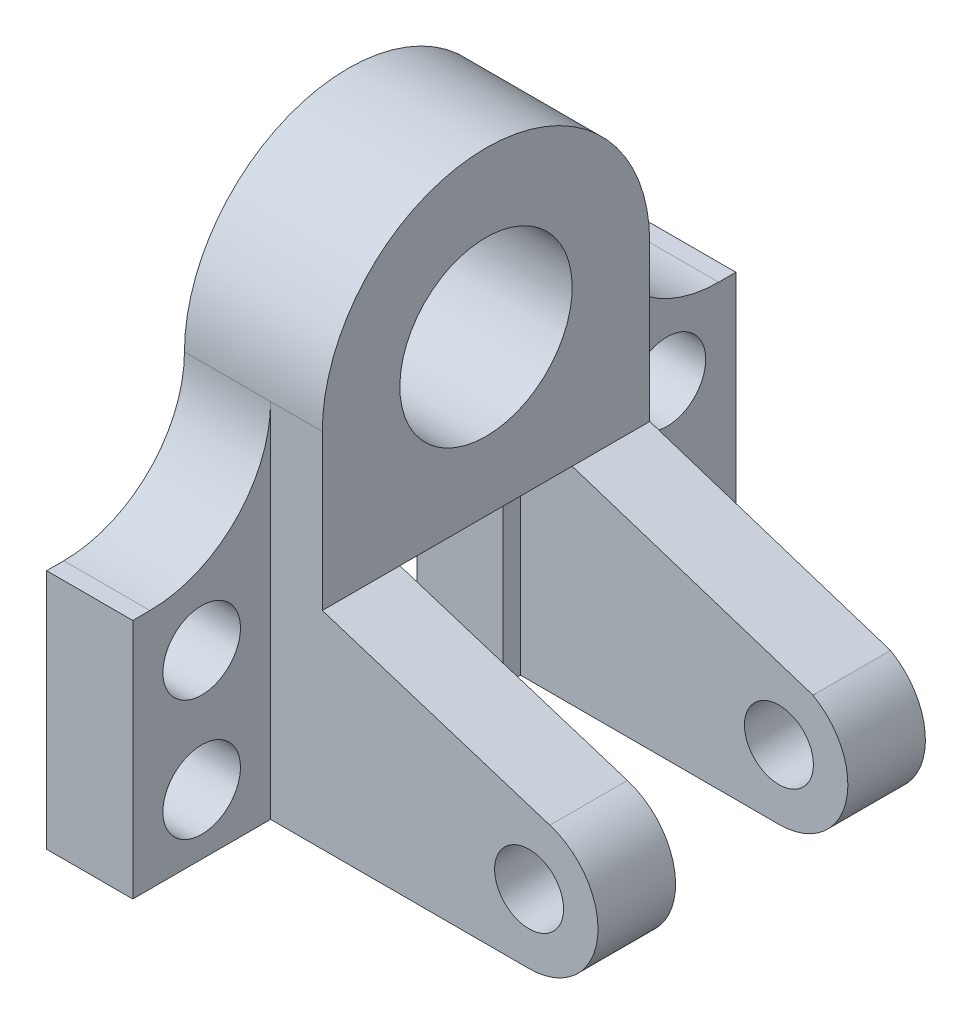
ISO-10303-21;
HEADER;
FILE_DESCRIPTION(('STEP AP214'),'2;1');
FILE_NAME('part.step','',(''),(''),'','','');
FILE_SCHEMA(('AUTOMOTIVE_DESIGN { 1 0 10303 214 1 1 1 1 }'));
ENDSEC;
DATA;
#1=APPLICATION_CONTEXT('core data for automotive mechanical design processes');
#2=APPLICATION_PROTOCOL_DEFINITION('international standard','automotive_design',2000,#1);
#3=PRODUCT_CONTEXT('',#1,'mechanical');
#4=PRODUCT('Part','Part','',(#3));
#5=PRODUCT_RELATED_PRODUCT_CATEGORY('part','',(#4));
#6=PRODUCT_DEFINITION_FORMATION('','',#4);
#7=PRODUCT_DEFINITION_CONTEXT('part definition',#1,'design');
#8=PRODUCT_DEFINITION('design','',#6,#7);
#9=PRODUCT_DEFINITION_SHAPE('','',#8);
#10=(LENGTH_UNIT() NAMED_UNIT(*) SI_UNIT(.MILLI.,.METRE.));
#11=(NAMED_UNIT(*) PLANE_ANGLE_UNIT() SI_UNIT($,.RADIAN.));
#12=(NAMED_UNIT(*) SI_UNIT($,.STERADIAN.) SOLID_ANGLE_UNIT());
#13=UNCERTAINTY_MEASURE_WITH_UNIT(LENGTH_MEASURE(1.E-05),#10,'distance_accuracy_value','');
#14=(GEOMETRIC_REPRESENTATION_CONTEXT(3) GLOBAL_UNCERTAINTY_ASSIGNED_CONTEXT((#13)) GLOBAL_UNIT_ASSIGNED_CONTEXT((#10,
#11,#12)) REPRESENTATION_CONTEXT('',''));
#15=CARTESIAN_POINT('',(0.,0.,0.));
#16=DIRECTION('',(0.,0.,1.));
#17=DIRECTION('',(1.,0.,0.));
#18=AXIS2_PLACEMENT_3D('',#15,#16,#17);
#19=CARTESIAN_POINT('',(0.,0.,457.2));
#20=DIRECTION('',(1.,0.,0.));
#21=DIRECTION('',(0.,1.,0.));
#22=AXIS2_PLACEMENT_3D('',#19,#20,#21);
#23=PLANE('',#22);
#24=CARTESIAN_POINT('',(1.02161018000306E-13,-863.6,-1879.6));
#25=DIRECTION('',(-1.,0.,0.));
#26=DIRECTION('',(0.,0.,1.));
#27=AXIS2_PLACEMENT_3D('',#24,#25,#26);
#28=CIRCLE('',#27,228.6);
#29=CARTESIAN_POINT('',(1.02161018000306E-13,-863.6,-1651.));
#30=VERTEX_POINT('',#29);
#31=EDGE_CURVE('E723',#30,#30,#28,.T.);
#32=ORIENTED_EDGE('',*,*,#31,.F.);
#33=EDGE_LOOP('',(#32));
#34=FACE_BOUND('',#33,.T.);
#35=CARTESIAN_POINT('',(0.,-152.4,-1879.6));
#36=DIRECTION('',(-1.,0.,0.));
#37=DIRECTION('',(0.,0.,1.));
#38=AXIS2_PLACEMENT_3D('',#35,#36,#37);
#39=CIRCLE('',#38,228.6);
#40=CARTESIAN_POINT('',(0.,-152.4,-1651.));
#41=VERTEX_POINT('',#40);
#42=EDGE_CURVE('E728',#41,#41,#39,.T.);
#43=ORIENTED_EDGE('',*,*,#42,.F.);
#44=EDGE_LOOP('',(#43));
#45=FACE_BOUND('',#44,.T.);
#46=DIRECTION('',(0.,1.,0.));
#47=VECTOR('',#46,1.);
#48=CARTESIAN_POINT('',(0.,0.,-914.4));
#49=LINE('',#48,#47);
#50=CARTESIAN_POINT('',(1.49308937752045E-13,-1219.2,-914.4));
#51=VERTEX_POINT('',#50);
#52=CARTESIAN_POINT('',(0.,0.,-914.4));
#53=VERTEX_POINT('',#52);
#54=EDGE_CURVE('E214',#51,#53,#49,.T.);
#55=ORIENTED_EDGE('',*,*,#54,.T.);
#56=DIRECTION('',(0.,0.,1.));
#57=VECTOR('',#56,1.);
#58=CARTESIAN_POINT('',(0.,0.,-1473.2));
#59=LINE('',#58,#57);
#60=CARTESIAN_POINT('',(0.,0.,-101.6));
#61=VERTEX_POINT('',#60);
#62=EDGE_CURVE('E326',#53,#61,#59,.T.);
#63=ORIENTED_EDGE('',*,*,#62,.T.);
#64=DIRECTION('',(0.,1.,0.));
#65=VECTOR('',#64,1.);
#66=CARTESIAN_POINT('',(0.,0.,-101.6));
#67=LINE('',#66,#65);
#68=CARTESIAN_POINT('',(1.49308937752045E-13,-1219.2,-101.6));
#69=VERTEX_POINT('',#68);
#70=EDGE_CURVE('E205',#69,#61,#67,.T.);
#71=ORIENTED_EDGE('',*,*,#70,.F.);
#72=DIRECTION('',(0.,0.,-1.));
#73=VECTOR('',#72,1.);
#74=CARTESIAN_POINT('',(1.49308937752045E-13,-1219.2,457.2));
#75=LINE('',#74,#73);
#76=CARTESIAN_POINT('',(1.49308937752045E-13,-1219.2,1270.));
#77=VERTEX_POINT('',#76);
#78=EDGE_CURVE('E196',#77,#69,#75,.T.);
#79=ORIENTED_EDGE('',*,*,#78,.F.);
#80=DIRECTION('',(0.,1.,0.));
#81=VECTOR('',#80,1.);
#82=CARTESIAN_POINT('',(0.,0.,1270.));
#83=LINE('',#82,#81);
#84=CARTESIAN_POINT('',(0.,203.2,1270.));
#85=VERTEX_POINT('',#84);
#86=EDGE_CURVE('E234',#77,#85,#83,.T.);
#87=ORIENTED_EDGE('',*,*,#86,.T.);
#88=DIRECTION('',(0.,0.,-1.));
#89=VECTOR('',#88,1.);
#90=CARTESIAN_POINT('',(0.,203.2,0.));
#91=LINE('',#90,#89);
#92=CARTESIAN_POINT('',(0.,203.2,1168.4));
#93=VERTEX_POINT('',#92);
#94=EDGE_CURVE('E241',#85,#93,#91,.T.);
#95=ORIENTED_EDGE('',*,*,#94,.T.);
#96=CARTESIAN_POINT('',(-1.11022302462516E-13,914.4,1168.4));
#97=DIRECTION('',(1.,0.,0.));
#98=DIRECTION('',(0.,1.,0.));
#99=AXIS2_PLACEMENT_3D('',#96,#97,#98);
#100=CIRCLE('',#99,711.2);
#101=CARTESIAN_POINT('',(-1.11981703314034E-13,914.4,457.2));
#102=VERTEX_POINT('',#101);
#103=EDGE_CURVE('E43',#93,#102,#100,.T.);
#104=ORIENTED_EDGE('',*,*,#103,.T.);
#105=CARTESIAN_POINT('',(-1.11981703314034E-13,914.4,-508.));
#106=DIRECTION('',(-1.,0.,0.));
#107=DIRECTION('',(0.,-1.,0.));
#108=AXIS2_PLACEMENT_3D('',#105,#106,#107);
#109=CIRCLE('',#108,965.2);
#110=CARTESIAN_POINT('',(-1.11981703314034E-13,914.4,-1473.2));
#111=VERTEX_POINT('',#110);
#112=EDGE_CURVE('E316',#102,#111,#109,.T.);
#113=ORIENTED_EDGE('',*,*,#112,.T.);
#114=CARTESIAN_POINT('',(-1.11981703314034E-13,914.4,-2184.4));
#115=DIRECTION('',(1.,0.,0.));
#116=DIRECTION('',(0.,1.,0.));
#117=AXIS2_PLACEMENT_3D('',#114,#115,#116);
#118=CIRCLE('',#117,711.2);
#119=CARTESIAN_POINT('',(0.,203.2,-2184.4));
#120=VERTEX_POINT('',#119);
#121=EDGE_CURVE('E349',#111,#120,#118,.T.);
#122=ORIENTED_EDGE('',*,*,#121,.T.);
#123=DIRECTION('',(0.,0.,1.));
#124=VECTOR('',#123,1.);
#125=CARTESIAN_POINT('',(0.,203.2,0.));
#126=LINE('',#125,#124);
#127=CARTESIAN_POINT('',(0.,203.2,-2286.));
#128=VERTEX_POINT('',#127);
#129=EDGE_CURVE('E254',#128,#120,#126,.T.);
#130=ORIENTED_EDGE('',*,*,#129,.F.);
#131=DIRECTION('',(0.,1.,0.));
#132=VECTOR('',#131,1.);
#133=CARTESIAN_POINT('',(0.,0.,-2286.));
#134=LINE('',#133,#132);
#135=CARTESIAN_POINT('',(1.49308937752045E-13,-1219.2,-2286.));
#136=VERTEX_POINT('',#135);
#137=EDGE_CURVE('E260',#136,#128,#134,.T.);
#138=ORIENTED_EDGE('',*,*,#137,.F.);
#139=DIRECTION('',(0.,0.,-1.));
#140=VECTOR('',#139,1.);
#141=CARTESIAN_POINT('',(-1.49308937752045E-13,-1219.2,-1016.));
#142=LINE('',#141,#140);
#143=EDGE_CURVE('E302',#51,#136,#142,.T.);
#144=ORIENTED_EDGE('',*,*,#143,.F.);
#145=EDGE_LOOP('',(#55,#63,#71,#79,#87,#95,#104,#113,#122,#130,#138,#144));
#146=FACE_BOUND('',#145,.T.);
#147=CARTESIAN_POINT('',(-1.11981703314034E-13,914.4,-508.));
#148=DIRECTION('',(-1.,0.,0.));
#149=DIRECTION('',(0.,-1.,0.));
#150=AXIS2_PLACEMENT_3D('',#147,#148,#149);
#151=CIRCLE('',#150,508.);
#152=CARTESIAN_POINT('',(0.,406.4,-508.));
#153=VERTEX_POINT('',#152);
#154=EDGE_CURVE('E304',#153,#153,#151,.T.);
#155=ORIENTED_EDGE('',*,*,#154,.F.);
#156=EDGE_LOOP('',(#155));
#157=FACE_BOUND('',#156,.T.);
#158=CARTESIAN_POINT('',(0.,-152.4,863.6));
#159=DIRECTION('',(-1.,0.,0.));
#160=DIRECTION('',(0.,0.,1.));
#161=AXIS2_PLACEMENT_3D('',#158,#159,#160);
#162=CIRCLE('',#161,228.6);
#163=CARTESIAN_POINT('',(0.,-152.4,1092.2));
#164=VERTEX_POINT('',#163);
#165=EDGE_CURVE('E715',#164,#164,#162,.T.);
#166=ORIENTED_EDGE('',*,*,#165,.F.);
#167=EDGE_LOOP('',(#166));
#168=FACE_BOUND('',#167,.T.);
#169=CARTESIAN_POINT('',(1.02161018000306E-13,-863.6,863.6));
#170=DIRECTION('',(-1.,0.,0.));
#171=DIRECTION('',(0.,0.,1.));
#172=AXIS2_PLACEMENT_3D('',#169,#170,#171);
#173=CIRCLE('',#172,228.6);
#174=CARTESIAN_POINT('',(1.02161018000306E-13,-863.6,1092.2));
#175=VERTEX_POINT('',#174);
#176=EDGE_CURVE('E712',#175,#175,#173,.T.);
#177=ORIENTED_EDGE('',*,*,#176,.F.);
#178=EDGE_LOOP('',(#177));
#179=FACE_BOUND('',#178,.T.);
#180=ADVANCED_FACE('F34',(#34,#45,#146,#157,#168,#179),#23,.F.);
#181=CARTESIAN_POINT('',(0.,0.,-1473.2));
#182=DIRECTION('',(0.,1.,0.));
#183=DIRECTION('',(0.,0.,1.));
#184=AXIS2_PLACEMENT_3D('',#181,#182,#183);
#185=PLANE('',#184);
#186=DIRECTION('',(-1.,0.,0.));
#187=VECTOR('',#186,1.);
#188=CARTESIAN_POINT('',(508.,0.,-101.6));
#189=LINE('',#188,#187);
#190=CARTESIAN_POINT('',(508.,0.,-101.6));
#191=VERTEX_POINT('',#190);
#192=EDGE_CURVE('E199',#191,#61,#189,.T.);
#193=ORIENTED_EDGE('',*,*,#192,.T.);
#194=ORIENTED_EDGE('',*,*,#62,.F.);
#195=DIRECTION('',(-1.,0.,0.));
#196=VECTOR('',#195,1.);
#197=CARTESIAN_POINT('',(508.,0.,-914.4));
#198=LINE('',#197,#196);
#199=CARTESIAN_POINT('',(508.,0.,-914.4));
#200=VERTEX_POINT('',#199);
#201=EDGE_CURVE('E231',#200,#53,#198,.T.);
#202=ORIENTED_EDGE('',*,*,#201,.F.);
#203=DIRECTION('',(0.,0.,1.));
#204=VECTOR('',#203,1.);
#205=CARTESIAN_POINT('',(508.,0.,0.));
#206=LINE('',#205,#204);
#207=CARTESIAN_POINT('',(508.,0.,-1016.));
#208=VERTEX_POINT('',#207);
#209=EDGE_CURVE('E222',#208,#200,#206,.T.);
#210=ORIENTED_EDGE('',*,*,#209,.F.);
#211=DIRECTION('',(-1.,0.,0.));
#212=VECTOR('',#211,1.);
#213=CARTESIAN_POINT('',(0.,0.,-1016.));
#214=LINE('',#213,#212);
#215=CARTESIAN_POINT('',(812.8,0.,-1016.));
#216=VERTEX_POINT('',#215);
#217=EDGE_CURVE('E292',#216,#208,#214,.T.);
#218=ORIENTED_EDGE('',*,*,#217,.F.);
#219=DIRECTION('',(0.,0.,1.));
#220=VECTOR('',#219,1.);
#221=CARTESIAN_POINT('',(812.8,0.,-1473.2));
#222=LINE('',#221,#220);
#223=CARTESIAN_POINT('',(812.8,0.,0.));
#224=VERTEX_POINT('',#223);
#225=EDGE_CURVE('E341',#216,#224,#222,.T.);
#226=ORIENTED_EDGE('',*,*,#225,.T.);
#227=DIRECTION('',(-1.,0.,0.));
#228=VECTOR('',#227,1.);
#229=CARTESIAN_POINT('',(0.,0.,0.));
#230=LINE('',#229,#228);
#231=CARTESIAN_POINT('',(508.,0.,0.));
#232=VERTEX_POINT('',#231);
#233=EDGE_CURVE('E383',#224,#232,#230,.T.);
#234=ORIENTED_EDGE('',*,*,#233,.T.);
#235=DIRECTION('',(0.,0.,1.));
#236=VECTOR('',#235,1.);
#237=CARTESIAN_POINT('',(508.,0.,0.));
#238=LINE('',#237,#236);
#239=EDGE_CURVE('E200',#191,#232,#238,.T.);
#240=ORIENTED_EDGE('',*,*,#239,.F.);
#241=EDGE_LOOP('',(#193,#194,#202,#210,#218,#226,#234,#240));
#242=FACE_BOUND('',#241,.T.);
#243=ADVANCED_FACE('F461',(#242),#185,.F.);
#244=CARTESIAN_POINT('',(2032.,-812.8,0.));
#245=DIRECTION('',(0.,0.,-1.));
#246=DIRECTION('',(-1.,0.,0.));
#247=AXIS2_PLACEMENT_3D('',#244,#245,#246);
#248=PLANE('',#247);
#249=CARTESIAN_POINT('',(2032.,-812.8,0.));
#250=DIRECTION('',(0.,0.,1.));
#251=DIRECTION('',(1.,0.,0.));
#252=AXIS2_PLACEMENT_3D('',#249,#250,#251);
#253=CIRCLE('',#252,203.2);
#254=CARTESIAN_POINT('',(2235.2,-812.8,0.));
#255=VERTEX_POINT('',#254);
#256=EDGE_CURVE('E398',#255,#255,#253,.T.);
#257=ORIENTED_EDGE('',*,*,#256,.T.);
#258=EDGE_LOOP('',(#257));
#259=FACE_BOUND('',#258,.T.);
#260=DIRECTION('',(1.,0.,0.));
#261=VECTOR('',#260,1.);
#262=CARTESIAN_POINT('',(1.49308937752045E-13,-1219.2,0.));
#263=LINE('',#262,#261);
#264=CARTESIAN_POINT('',(508.,-1219.2,0.));
#265=VERTEX_POINT('',#264);
#266=CARTESIAN_POINT('',(2032.,-1219.2,0.));
#267=VERTEX_POINT('',#266);
#268=EDGE_CURVE('E395',#265,#267,#263,.T.);
#269=ORIENTED_EDGE('',*,*,#268,.F.);
#270=DIRECTION('',(0.,-1.,0.));
#271=VECTOR('',#270,1.);
#272=CARTESIAN_POINT('',(508.,0.,0.));
#273=LINE('',#272,#271);
#274=EDGE_CURVE('E188',#232,#265,#273,.T.);
#275=ORIENTED_EDGE('',*,*,#274,.F.);
#276=ORIENTED_EDGE('',*,*,#233,.F.);
#277=DIRECTION('',(-0.953254218877943,0.302169479251962,0.));
#278=VECTOR('',#277,1.);
#279=CARTESIAN_POINT('',(812.8,0.,0.));
#280=LINE('',#279,#278);
#281=CARTESIAN_POINT('',(2154.801676368,-425.397485448004,0.));
#282=VERTEX_POINT('',#281);
#283=EDGE_CURVE('E388',#282,#224,#280,.T.);
#284=ORIENTED_EDGE('',*,*,#283,.F.);
#285=CARTESIAN_POINT('',(2032.,-812.8,0.));
#286=DIRECTION('',(0.,0.,1.));
#287=DIRECTION('',(-1.,0.,0.));
#288=AXIS2_PLACEMENT_3D('',#285,#286,#287);
#289=CIRCLE('',#288,406.4);
#290=EDGE_CURVE('E397',#267,#282,#289,.T.);
#291=ORIENTED_EDGE('',*,*,#290,.F.);
#292=EDGE_LOOP('',(#269,#275,#276,#284,#291));
#293=FACE_BOUND('',#292,.T.);
#294=ADVANCED_FACE('F425',(#259,#293),#248,.T.);
#295=CARTESIAN_POINT('',(0.,0.,-1016.));
#296=DIRECTION('',(0.,0.,-1.));
#297=DIRECTION('',(-1.,0.,0.));
#298=AXIS2_PLACEMENT_3D('',#295,#296,#297);
#299=PLANE('',#298);
#300=CARTESIAN_POINT('',(2032.,-812.800000000001,-1016.));
#301=DIRECTION('',(0.,0.,-1.));
#302=DIRECTION('',(-1.,0.,0.));
#303=AXIS2_PLACEMENT_3D('',#300,#301,#302);
#304=CIRCLE('',#303,203.2);
#305=CARTESIAN_POINT('',(1828.8,-812.800000000001,-1016.));
#306=VERTEX_POINT('',#305);
#307=EDGE_CURVE('E274',#306,#306,#304,.F.);
#308=ORIENTED_EDGE('',*,*,#307,.F.);
#309=EDGE_LOOP('',(#308));
#310=FACE_BOUND('',#309,.T.);
#311=DIRECTION('',(0.,1.,0.));
#312=VECTOR('',#311,1.);
#313=CARTESIAN_POINT('',(508.,0.,-1016.));
#314=LINE('',#313,#312);
#315=CARTESIAN_POINT('',(508.,-1219.2,-1016.));
#316=VERTEX_POINT('',#315);
#317=EDGE_CURVE('E225',#316,#208,#314,.T.);
#318=ORIENTED_EDGE('',*,*,#317,.F.);
#319=DIRECTION('',(1.,0.,0.));
#320=VECTOR('',#319,1.);
#321=CARTESIAN_POINT('',(0.,-1219.2,-1016.));
#322=LINE('',#321,#320);
#323=CARTESIAN_POINT('',(2032.,-1219.2,-1016.));
#324=VERTEX_POINT('',#323);
#325=EDGE_CURVE('E290',#316,#324,#322,.T.);
#326=ORIENTED_EDGE('',*,*,#325,.T.);
#327=CARTESIAN_POINT('',(2032.,-812.800000000001,-1016.));
#328=DIRECTION('',(0.,0.,-1.));
#329=DIRECTION('',(-1.,0.,0.));
#330=AXIS2_PLACEMENT_3D('',#327,#328,#329);
#331=CIRCLE('',#330,406.4);
#332=CARTESIAN_POINT('',(2232.37091853785,-459.228995809471,-1016.));
#333=VERTEX_POINT('',#332);
#334=EDGE_CURVE('E286',#333,#324,#331,.T.);
#335=ORIENTED_EDGE('',*,*,#334,.F.);
#336=DIRECTION('',(0.951453145071876,-0.307793620357595,0.));
#337=VECTOR('',#336,1.);
#338=CARTESIAN_POINT('',(77.0021626692485,238.0294619618,-1016.));
#339=LINE('',#338,#337);
#340=EDGE_CURVE('E283',#216,#333,#339,.T.);
#341=ORIENTED_EDGE('',*,*,#340,.F.);
#342=ORIENTED_EDGE('',*,*,#217,.T.);
#343=EDGE_LOOP('',(#318,#326,#335,#341,#342));
#344=FACE_BOUND('',#343,.T.);
#345=ADVANCED_FACE('F466',(#310,#344),#299,.F.);
#346=CARTESIAN_POINT('',(0.,0.,-1473.2));
#347=DIRECTION('',(0.,0.,1.));
#348=DIRECTION('',(1.,0.,0.));
#349=AXIS2_PLACEMENT_3D('',#346,#347,#348);
#350=PLANE('',#349);
#351=CARTESIAN_POINT('',(2032.,-812.800000000001,-1473.2));
#352=DIRECTION('',(0.,0.,1.));
#353=DIRECTION('',(1.,0.,0.));
#354=AXIS2_PLACEMENT_3D('',#351,#352,#353);
#355=CIRCLE('',#354,203.2);
#356=CARTESIAN_POINT('',(2235.2,-812.800000000001,-1473.2));
#357=VERTEX_POINT('',#356);
#358=EDGE_CURVE('E279',#357,#357,#355,.F.);
#359=ORIENTED_EDGE('',*,*,#358,.F.);
#360=EDGE_LOOP('',(#359));
#361=FACE_BOUND('',#360,.T.);
#362=DIRECTION('',(0.,-1.,0.));
#363=VECTOR('',#362,1.);
#364=CARTESIAN_POINT('',(508.,0.,-1473.2));
#365=LINE('',#364,#363);
#366=CARTESIAN_POINT('',(508.,914.4,-1473.2));
#367=VERTEX_POINT('',#366);
#368=CARTESIAN_POINT('',(508.,-1219.2,-1473.2));
#369=VERTEX_POINT('',#368);
#370=EDGE_CURVE('E264',#367,#369,#365,.T.);
#371=ORIENTED_EDGE('',*,*,#370,.F.);
#372=DIRECTION('',(1.,0.,0.));
#373=VECTOR('',#372,1.);
#374=CARTESIAN_POINT('',(0.,914.4,-1473.2));
#375=LINE('',#374,#373);
#376=CARTESIAN_POINT('',(812.8,914.4,-1473.2));
#377=VERTEX_POINT('',#376);
#378=EDGE_CURVE('E323',#367,#377,#375,.T.);
#379=ORIENTED_EDGE('',*,*,#378,.T.);
#380=DIRECTION('',(0.,1.,0.));
#381=VECTOR('',#380,1.);
#382=CARTESIAN_POINT('',(812.8,0.,-1473.2));
#383=LINE('',#382,#381);
#384=CARTESIAN_POINT('',(812.8,0.,-1473.2));
#385=VERTEX_POINT('',#384);
#386=EDGE_CURVE('E322',#385,#377,#383,.T.);
#387=ORIENTED_EDGE('',*,*,#386,.F.);
#388=DIRECTION('',(0.951453145071876,-0.307793620357595,0.));
#389=VECTOR('',#388,1.);
#390=CARTESIAN_POINT('',(77.0021626692485,238.0294619618,-1473.2));
#391=LINE('',#390,#389);
#392=CARTESIAN_POINT('',(2232.37091853785,-459.228995809471,-1473.2));
#393=VERTEX_POINT('',#392);
#394=EDGE_CURVE('E282',#385,#393,#391,.T.);
#395=ORIENTED_EDGE('',*,*,#394,.T.);
#396=CARTESIAN_POINT('',(2032.,-812.800000000001,-1473.2));
#397=DIRECTION('',(0.,0.,-1.));
#398=DIRECTION('',(-1.,0.,0.));
#399=AXIS2_PLACEMENT_3D('',#396,#397,#398);
#400=CIRCLE('',#399,406.4);
#401=CARTESIAN_POINT('',(2032.,-1219.2,-1473.2));
#402=VERTEX_POINT('',#401);
#403=EDGE_CURVE('E298',#393,#402,#400,.T.);
#404=ORIENTED_EDGE('',*,*,#403,.T.);
#405=DIRECTION('',(1.,0.,0.));
#406=VECTOR('',#405,1.);
#407=CARTESIAN_POINT('',(0.,-1219.2,-1473.2));
#408=LINE('',#407,#406);
#409=EDGE_CURVE('E287',#369,#402,#408,.T.);
#410=ORIENTED_EDGE('',*,*,#409,.F.);
#411=EDGE_LOOP('',(#371,#379,#387,#395,#404,#410));
#412=FACE_BOUND('',#411,.T.);
#413=ADVANCED_FACE('F434',(#361,#412),#350,.F.);
#414=CARTESIAN_POINT('',(1.49308937752045E-13,-1219.2,457.2));
#415=DIRECTION('',(0.,1.,0.));
#416=DIRECTION('',(0.,0.,1.));
#417=AXIS2_PLACEMENT_3D('',#414,#415,#416);
#418=PLANE('',#417);
#419=ORIENTED_EDGE('',*,*,#78,.T.);
#420=DIRECTION('',(-1.,0.,0.));
#421=VECTOR('',#420,1.);
#422=CARTESIAN_POINT('',(508.,-1219.2,-101.6));
#423=LINE('',#422,#421);
#424=CARTESIAN_POINT('',(508.,-1219.2,-101.6));
#425=VERTEX_POINT('',#424);
#426=EDGE_CURVE('E193',#425,#69,#423,.T.);
#427=ORIENTED_EDGE('',*,*,#426,.F.);
#428=DIRECTION('',(0.,0.,-1.));
#429=VECTOR('',#428,1.);
#430=CARTESIAN_POINT('',(508.,-1219.2,0.));
#431=LINE('',#430,#429);
#432=EDGE_CURVE('E181',#265,#425,#431,.T.);
#433=ORIENTED_EDGE('',*,*,#432,.F.);
#434=ORIENTED_EDGE('',*,*,#268,.T.);
#435=DIRECTION('',(0.,0.,-1.));
#436=VECTOR('',#435,1.);
#437=CARTESIAN_POINT('',(2032.,-1219.2,457.2));
#438=LINE('',#437,#436);
#439=CARTESIAN_POINT('',(2032.,-1219.2,457.2));
#440=VERTEX_POINT('',#439);
#441=EDGE_CURVE('E379',#440,#267,#438,.T.);
#442=ORIENTED_EDGE('',*,*,#441,.F.);
#443=DIRECTION('',(1.,0.,0.));
#444=VECTOR('',#443,1.);
#445=CARTESIAN_POINT('',(1.49308937752045E-13,-1219.2,457.2));
#446=LINE('',#445,#444);
#447=CARTESIAN_POINT('',(508.,-1219.2,457.2));
#448=VERTEX_POINT('',#447);
#449=EDGE_CURVE('E377',#448,#440,#446,.T.);
#450=ORIENTED_EDGE('',*,*,#449,.F.);
#451=DIRECTION('',(0.,0.,1.));
#452=VECTOR('',#451,1.);
#453=CARTESIAN_POINT('',(508.,-1219.2,0.));
#454=LINE('',#453,#452);
#455=CARTESIAN_POINT('',(508.,-1219.2,1270.));
#456=VERTEX_POINT('',#455);
#457=EDGE_CURVE('E244',#448,#456,#454,.T.);
#458=ORIENTED_EDGE('',*,*,#457,.T.);
#459=DIRECTION('',(-1.,0.,0.));
#460=VECTOR('',#459,1.);
#461=CARTESIAN_POINT('',(508.,-1219.2,1270.));
#462=LINE('',#461,#460);
#463=EDGE_CURVE('E252',#456,#77,#462,.T.);
#464=ORIENTED_EDGE('',*,*,#463,.T.);
#465=EDGE_LOOP('',(#419,#427,#433,#434,#442,#450,#458,#464));
#466=FACE_BOUND('',#465,.T.);
#467=ADVANCED_FACE('F194',(#466),#418,.F.);
#468=CARTESIAN_POINT('',(2032.,-812.8,457.2));
#469=DIRECTION('',(0.,0.,-1.));
#470=DIRECTION('',(-1.,0.,0.));
#471=AXIS2_PLACEMENT_3D('',#468,#469,#470);
#472=CYLINDRICAL_SURFACE('',#471,406.4);
#473=ORIENTED_EDGE('',*,*,#290,.T.);
#474=DIRECTION('',(0.,0.,-1.));
#475=VECTOR('',#474,1.);
#476=CARTESIAN_POINT('',(2154.801676368,-425.397485448004,457.2));
#477=LINE('',#476,#475);
#478=CARTESIAN_POINT('',(2154.801676368,-425.397485448004,457.2));
#479=VERTEX_POINT('',#478);
#480=EDGE_CURVE('E402',#479,#282,#477,.T.);
#481=ORIENTED_EDGE('',*,*,#480,.F.);
#482=CARTESIAN_POINT('',(2032.,-812.8,457.2));
#483=DIRECTION('',(0.,0.,1.));
#484=DIRECTION('',(-1.,0.,0.));
#485=AXIS2_PLACEMENT_3D('',#482,#483,#484);
#486=CIRCLE('',#485,406.4);
#487=EDGE_CURVE('E382',#440,#479,#486,.T.);
#488=ORIENTED_EDGE('',*,*,#487,.F.);
#489=ORIENTED_EDGE('',*,*,#441,.T.);
#490=EDGE_LOOP('',(#473,#481,#488,#489));
#491=FACE_BOUND('',#490,.T.);
#492=ADVANCED_FACE('F423',(#491),#472,.T.);
#493=CARTESIAN_POINT('',(812.8,0.,457.2));
#494=DIRECTION('',(-0.302169479251962,-0.953254218877943,0.));
#495=DIRECTION('',(0.953254218877943,-0.302169479251962,0.));
#496=AXIS2_PLACEMENT_3D('',#493,#494,#495);
#497=PLANE('',#496);
#498=ORIENTED_EDGE('',*,*,#283,.T.);
#499=DIRECTION('',(0.,0.,-1.));
#500=VECTOR('',#499,1.);
#501=CARTESIAN_POINT('',(812.8,0.,457.2));
#502=LINE('',#501,#500);
#503=CARTESIAN_POINT('',(812.8,0.,457.2));
#504=VERTEX_POINT('',#503);
#505=EDGE_CURVE('E394',#504,#224,#502,.T.);
#506=ORIENTED_EDGE('',*,*,#505,.F.);
#507=DIRECTION('',(-0.953254218877943,0.302169479251962,0.));
#508=VECTOR('',#507,1.);
#509=CARTESIAN_POINT('',(812.8,0.,457.2));
#510=LINE('',#509,#508);
#511=EDGE_CURVE('E385',#479,#504,#510,.T.);
#512=ORIENTED_EDGE('',*,*,#511,.F.);
#513=ORIENTED_EDGE('',*,*,#480,.T.);
#514=EDGE_LOOP('',(#498,#506,#512,#513));
#515=FACE_BOUND('',#514,.T.);
#516=ADVANCED_FACE('F427',(#515),#497,.F.);
#517=CARTESIAN_POINT('',(2032.,-812.8,457.2));
#518=DIRECTION('',(0.,0.,-1.));
#519=DIRECTION('',(-1.,0.,0.));
#520=AXIS2_PLACEMENT_3D('',#517,#518,#519);
#521=PLANE('',#520);
#522=CARTESIAN_POINT('',(2032.,-812.8,457.2));
#523=DIRECTION('',(0.,0.,1.));
#524=DIRECTION('',(1.,0.,0.));
#525=AXIS2_PLACEMENT_3D('',#522,#523,#524);
#526=CIRCLE('',#525,203.2);
#527=CARTESIAN_POINT('',(2235.2,-812.8,457.2));
#528=VERTEX_POINT('',#527);
#529=EDGE_CURVE('E391',#528,#528,#526,.T.);
#530=ORIENTED_EDGE('',*,*,#529,.F.);
#531=EDGE_LOOP('',(#530));
#532=FACE_BOUND('',#531,.T.);
#533=DIRECTION('',(1.,0.,0.));
#534=VECTOR('',#533,1.);
#535=CARTESIAN_POINT('',(0.,914.4,457.2));
#536=LINE('',#535,#534);
#537=CARTESIAN_POINT('',(508.,914.4,457.2));
#538=VERTEX_POINT('',#537);
#539=CARTESIAN_POINT('',(812.8,914.4,457.2));
#540=VERTEX_POINT('',#539);
#541=EDGE_CURVE('E315',#538,#540,#536,.T.);
#542=ORIENTED_EDGE('',*,*,#541,.F.);
#543=DIRECTION('',(0.,1.,0.));
#544=VECTOR('',#543,1.);
#545=CARTESIAN_POINT('',(508.,0.,457.2));
#546=LINE('',#545,#544);
#547=EDGE_CURVE('E49',#448,#538,#546,.T.);
#548=ORIENTED_EDGE('',*,*,#547,.F.);
#549=ORIENTED_EDGE('',*,*,#449,.T.);
#550=ORIENTED_EDGE('',*,*,#487,.T.);
#551=ORIENTED_EDGE('',*,*,#511,.T.);
#552=DIRECTION('',(0.,1.,0.));
#553=VECTOR('',#552,1.);
#554=CARTESIAN_POINT('',(812.8,0.,457.2));
#555=LINE('',#554,#553);
#556=EDGE_CURVE('E330',#504,#540,#555,.T.);
#557=ORIENTED_EDGE('',*,*,#556,.T.);
#558=EDGE_LOOP('',(#542,#548,#549,#550,#551,#557));
#559=FACE_BOUND('',#558,.T.);
#560=ADVANCED_FACE('F430',(#532,#559),#521,.F.);
#561=CARTESIAN_POINT('',(2032.,-812.8,0.));
#562=DIRECTION('',(0.,0.,1.));
#563=DIRECTION('',(1.,0.,0.));
#564=AXIS2_PLACEMENT_3D('',#561,#562,#563);
#565=CYLINDRICAL_SURFACE('',#564,203.2);
#566=ORIENTED_EDGE('',*,*,#256,.F.);
#567=EDGE_LOOP('',(#566));
#568=FACE_BOUND('',#567,.T.);
#569=ORIENTED_EDGE('',*,*,#529,.T.);
#570=EDGE_LOOP('',(#569));
#571=FACE_BOUND('',#570,.T.);
#572=ADVANCED_FACE('F482',(#568,#571),#565,.F.);
#573=CARTESIAN_POINT('',(812.8,0.,-1473.2));
#574=DIRECTION('',(1.,0.,0.));
#575=DIRECTION('',(0.,0.,-1.));
#576=AXIS2_PLACEMENT_3D('',#573,#574,#575);
#577=PLANE('',#576);
#578=CARTESIAN_POINT('',(812.8,914.4,-508.));
#579=DIRECTION('',(1.,0.,0.));
#580=DIRECTION('',(0.,0.,-1.));
#581=AXIS2_PLACEMENT_3D('',#578,#579,#580);
#582=CIRCLE('',#581,508.);
#583=CARTESIAN_POINT('',(812.8,406.4,-508.));
#584=VERTEX_POINT('',#583);
#585=EDGE_CURVE('E311',#584,#584,#582,.T.);
#586=ORIENTED_EDGE('',*,*,#585,.F.);
#587=EDGE_LOOP('',(#586));
#588=FACE_BOUND('',#587,.T.);
#589=ORIENTED_EDGE('',*,*,#556,.F.);
#590=ORIENTED_EDGE('',*,*,#505,.T.);
#591=ORIENTED_EDGE('',*,*,#225,.F.);
#592=EDGE_CURVE('E338',#385,#216,#222,.T.);
#593=ORIENTED_EDGE('',*,*,#592,.F.);
#594=ORIENTED_EDGE('',*,*,#386,.T.);
#595=CARTESIAN_POINT('',(812.8,914.4,-508.));
#596=DIRECTION('',(-1.,0.,0.));
#597=DIRECTION('',(0.,-1.,0.));
#598=AXIS2_PLACEMENT_3D('',#595,#596,#597);
#599=CIRCLE('',#598,965.2);
#600=EDGE_CURVE('E312',#540,#377,#599,.T.);
#601=ORIENTED_EDGE('',*,*,#600,.F.);
#602=EDGE_LOOP('',(#589,#590,#591,#593,#594,#601));
#603=FACE_BOUND('',#602,.T.);
#604=ADVANCED_FACE('F429',(#588,#603),#577,.T.);
#605=CARTESIAN_POINT('',(812.8,914.4,-508.));
#606=DIRECTION('',(-1.,0.,0.));
#607=DIRECTION('',(0.,-1.,0.));
#608=AXIS2_PLACEMENT_3D('',#605,#606,#607);
#609=CYLINDRICAL_SURFACE('',#608,965.2);
#610=ORIENTED_EDGE('',*,*,#112,.F.);
#611=EDGE_CURVE('E327',#102,#538,#536,.T.);
#612=ORIENTED_EDGE('',*,*,#611,.T.);
#613=ORIENTED_EDGE('',*,*,#541,.T.);
#614=ORIENTED_EDGE('',*,*,#600,.T.);
#615=ORIENTED_EDGE('',*,*,#378,.F.);
#616=EDGE_CURVE('E319',#111,#367,#375,.T.);
#617=ORIENTED_EDGE('',*,*,#616,.F.);
#618=EDGE_LOOP('',(#610,#612,#613,#614,#615,#617));
#619=FACE_BOUND('',#618,.T.);
#620=ADVANCED_FACE('F366',(#619),#609,.T.);
#621=CARTESIAN_POINT('',(2438.4,914.4,-508.));
#622=DIRECTION('',(-1.,0.,0.));
#623=DIRECTION('',(0.,-1.,0.));
#624=AXIS2_PLACEMENT_3D('',#621,#622,#623);
#625=CYLINDRICAL_SURFACE('',#624,508.);
#626=CARTESIAN_POINT('',(812.8,406.4,-508.));
#627=CARTESIAN_POINT('',(804.333333333333,406.4,-508.));
#628=CARTESIAN_POINT('',(795.866666666667,406.4,-508.));
#629=CARTESIAN_POINT('',(778.933333333333,406.4,-508.));
#630=CARTESIAN_POINT('',(770.466666666667,406.4,-508.));
#631=CARTESIAN_POINT('',(753.533333333333,406.4,-508.));
#632=CARTESIAN_POINT('',(745.066666666667,406.4,-508.));
#633=CARTESIAN_POINT('',(728.133333333333,406.4,-508.));
#634=CARTESIAN_POINT('',(719.666666666667,406.4,-508.));
#635=CARTESIAN_POINT('',(702.733333333333,406.4,-508.));
#636=CARTESIAN_POINT('',(694.266666666667,406.4,-508.));
#637=CARTESIAN_POINT('',(677.333333333333,406.4,-508.));
#638=CARTESIAN_POINT('',(668.866666666667,406.4,-508.));
#639=CARTESIAN_POINT('',(651.933333333333,406.4,-508.));
#640=CARTESIAN_POINT('',(643.466666666667,406.4,-508.));
#641=CARTESIAN_POINT('',(626.533333333333,406.4,-508.));
#642=CARTESIAN_POINT('',(618.066666666667,406.4,-508.));
#643=CARTESIAN_POINT('',(601.133333333333,406.4,-508.));
#644=CARTESIAN_POINT('',(592.666666666667,406.4,-508.));
#645=CARTESIAN_POINT('',(575.733333333333,406.4,-508.));
#646=CARTESIAN_POINT('',(567.266666666667,406.4,-508.));
#647=CARTESIAN_POINT('',(550.333333333333,406.4,-508.));
#648=CARTESIAN_POINT('',(541.866666666667,406.4,-508.));
#649=CARTESIAN_POINT('',(524.933333333333,406.4,-508.));
#650=CARTESIAN_POINT('',(516.466666666666,406.4,-508.));
#651=CARTESIAN_POINT('',(499.533333333333,406.4,-508.));
#652=CARTESIAN_POINT('',(491.066666666667,406.4,-508.));
#653=CARTESIAN_POINT('',(474.133333333333,406.4,-508.));
#654=CARTESIAN_POINT('',(465.666666666667,406.4,-508.));
#655=CARTESIAN_POINT('',(448.733333333333,406.4,-508.));
#656=CARTESIAN_POINT('',(440.266666666667,406.4,-508.));
#657=CARTESIAN_POINT('',(423.333333333333,406.4,-508.));
#658=CARTESIAN_POINT('',(414.866666666667,406.4,-508.));
#659=CARTESIAN_POINT('',(397.933333333333,406.4,-508.));
#660=CARTESIAN_POINT('',(389.466666666667,406.4,-508.));
#661=CARTESIAN_POINT('',(372.533333333333,406.4,-508.));
#662=CARTESIAN_POINT('',(364.066666666667,406.4,-508.));
#663=CARTESIAN_POINT('',(347.133333333333,406.4,-508.));
#664=CARTESIAN_POINT('',(338.666666666667,406.4,-508.));
#665=CARTESIAN_POINT('',(321.733333333333,406.4,-508.));
#666=CARTESIAN_POINT('',(313.266666666667,406.4,-508.));
#667=CARTESIAN_POINT('',(296.333333333333,406.4,-508.));
#668=CARTESIAN_POINT('',(287.866666666667,406.4,-508.));
#669=CARTESIAN_POINT('',(270.933333333333,406.4,-508.));
#670=CARTESIAN_POINT('',(262.466666666667,406.4,-508.));
#671=CARTESIAN_POINT('',(245.533333333333,406.4,-508.));
#672=CARTESIAN_POINT('',(237.066666666667,406.4,-508.));
#673=CARTESIAN_POINT('',(220.133333333333,406.4,-508.));
#674=CARTESIAN_POINT('',(211.666666666667,406.4,-508.));
#675=CARTESIAN_POINT('',(194.733333333333,406.4,-508.));
#676=CARTESIAN_POINT('',(186.266666666667,406.4,-508.));
#677=CARTESIAN_POINT('',(169.333333333333,406.4,-508.));
#678=CARTESIAN_POINT('',(160.866666666667,406.4,-508.));
#679=CARTESIAN_POINT('',(143.933333333333,406.4,-508.));
#680=CARTESIAN_POINT('',(135.466666666667,406.4,-508.));
#681=CARTESIAN_POINT('',(118.533333333333,406.4,-508.));
#682=CARTESIAN_POINT('',(110.066666666667,406.4,-508.));
#683=CARTESIAN_POINT('',(93.1333333333333,406.4,-508.));
#684=CARTESIAN_POINT('',(84.6666666666667,406.4,-508.));
#685=CARTESIAN_POINT('',(67.7333333333333,406.4,-508.));
#686=CARTESIAN_POINT('',(59.2666666666665,406.4,-508.));
#687=CARTESIAN_POINT('',(42.3333333333331,406.4,-508.));
#688=CARTESIAN_POINT('',(33.8666666666665,406.4,-508.));
#689=CARTESIAN_POINT('',(16.9333333333332,406.4,-508.));
#690=CARTESIAN_POINT('',(8.46666666666662,406.4,-508.));
#691=CARTESIAN_POINT('',(0.,406.4,-508.));
#692=B_SPLINE_CURVE_WITH_KNOTS('',3,(#626,#627,#628,#629,#630,#631,#632,#633,#634,#635,#636,
#637,#638,#639,#640,#641,#642,#643,#644,#645,#646,#647,#648,#649,#650,#651,#652,#653,#654,#655,
#656,#657,#658,#659,#660,#661,#662,#663,#664,#665,#666,#667,#668,#669,#670,#671,#672,#673,#674,
#675,#676,#677,#678,#679,#680,#681,#682,#683,#684,#685,#686,#687,#688,#689,#690,#691),
.UNSPECIFIED.,.F.,.F.,(4,2,2,2,2,2,2,2,2,2,2,2,2,2,2,2,2,2,2,2,2,2,2,2,2,2,2,2,2,2,2,2,4),(0.,
25.4000000000001,50.8,76.2,101.6,127.,152.4,177.8,203.2,228.6,254.,279.4,304.8,330.2,355.6,381.,
406.4,431.8,457.2,482.6,508.,533.4,558.8,584.2,609.6,635.,660.4,685.8,711.2,736.6,762.,787.4,
812.8),.UNSPECIFIED.);
#693=EDGE_CURVE('BSEAM549',#584,#153,#692,.T.);
#694=ORIENTED_EDGE('',*,*,#585,.T.);
#695=ORIENTED_EDGE('',*,*,#154,.T.);
#696=ORIENTED_EDGE('',*,*,#693,.T.);
#697=ORIENTED_EDGE('',*,*,#693,.F.);
#698=EDGE_LOOP('',(#694,#696,#695,#697));
#699=FACE_BOUND('',#698,.T.);
#700=ADVANCED_FACE('F549',(#699),#625,.F.);
#701=CARTESIAN_POINT('',(77.0021626692485,238.0294619618,-1016.));
#702=DIRECTION('',(0.307793620357595,0.951453145071876,0.));
#703=DIRECTION('',(-0.951453145071876,0.307793620357595,0.));
#704=AXIS2_PLACEMENT_3D('',#701,#702,#703);
#705=PLANE('',#704);
#706=ORIENTED_EDGE('',*,*,#394,.F.);
#707=ORIENTED_EDGE('',*,*,#592,.T.);
#708=ORIENTED_EDGE('',*,*,#340,.T.);
#709=DIRECTION('',(0.,0.,-1.));
#710=VECTOR('',#709,1.);
#711=CARTESIAN_POINT('',(2232.37091853785,-459.228995809471,-1016.));
#712=LINE('',#711,#710);
#713=EDGE_CURVE('E295',#333,#393,#712,.T.);
#714=ORIENTED_EDGE('',*,*,#713,.T.);
#715=EDGE_LOOP('',(#706,#707,#708,#714));
#716=FACE_BOUND('',#715,.T.);
#717=ADVANCED_FACE('F474',(#716),#705,.T.);
#718=CARTESIAN_POINT('',(0.,-1219.2,-1016.));
#719=DIRECTION('',(0.,1.,0.));
#720=DIRECTION('',(0.,0.,1.));
#721=AXIS2_PLACEMENT_3D('',#718,#719,#720);
#722=PLANE('',#721);
#723=ORIENTED_EDGE('',*,*,#143,.T.);
#724=DIRECTION('',(-1.,0.,0.));
#725=VECTOR('',#724,1.);
#726=CARTESIAN_POINT('',(508.,-1219.2,-2286.));
#727=LINE('',#726,#725);
#728=CARTESIAN_POINT('',(508.,-1219.2,-2286.));
#729=VERTEX_POINT('',#728);
#730=EDGE_CURVE('E271',#729,#136,#727,.T.);
#731=ORIENTED_EDGE('',*,*,#730,.F.);
#732=DIRECTION('',(0.,0.,-1.));
#733=VECTOR('',#732,1.);
#734=CARTESIAN_POINT('',(508.,-1219.2,0.));
#735=LINE('',#734,#733);
#736=EDGE_CURVE('E262',#369,#729,#735,.T.);
#737=ORIENTED_EDGE('',*,*,#736,.F.);
#738=ORIENTED_EDGE('',*,*,#409,.T.);
#739=DIRECTION('',(0.,0.,-1.));
#740=VECTOR('',#739,1.);
#741=CARTESIAN_POINT('',(2032.,-1219.2,-1016.));
#742=LINE('',#741,#740);
#743=EDGE_CURVE('E305',#324,#402,#742,.T.);
#744=ORIENTED_EDGE('',*,*,#743,.F.);
#745=ORIENTED_EDGE('',*,*,#325,.F.);
#746=DIRECTION('',(0.,0.,1.));
#747=VECTOR('',#746,1.);
#748=CARTESIAN_POINT('',(508.,-1219.2,0.));
#749=LINE('',#748,#747);
#750=CARTESIAN_POINT('',(508.,-1219.2,-914.4));
#751=VERTEX_POINT('',#750);
#752=EDGE_CURVE('E216',#316,#751,#749,.T.);
#753=ORIENTED_EDGE('',*,*,#752,.T.);
#754=DIRECTION('',(-1.,0.,0.));
#755=VECTOR('',#754,1.);
#756=CARTESIAN_POINT('',(508.,-1219.2,-914.4));
#757=LINE('',#756,#755);
#758=EDGE_CURVE('E228',#751,#51,#757,.T.);
#759=ORIENTED_EDGE('',*,*,#758,.T.);
#760=EDGE_LOOP('',(#723,#731,#737,#738,#744,#745,#753,#759));
#761=FACE_BOUND('',#760,.T.);
#762=ADVANCED_FACE('F454',(#761),#722,.F.);
#763=CARTESIAN_POINT('',(2032.,-812.800000000001,-1016.));
#764=DIRECTION('',(0.,0.,-1.));
#765=DIRECTION('',(-1.,0.,0.));
#766=AXIS2_PLACEMENT_3D('',#763,#764,#765);
#767=CYLINDRICAL_SURFACE('',#766,406.4);
#768=ORIENTED_EDGE('',*,*,#403,.F.);
#769=ORIENTED_EDGE('',*,*,#713,.F.);
#770=ORIENTED_EDGE('',*,*,#334,.T.);
#771=ORIENTED_EDGE('',*,*,#743,.T.);
#772=EDGE_LOOP('',(#768,#769,#770,#771));
#773=FACE_BOUND('',#772,.T.);
#774=ADVANCED_FACE('F472',(#773),#767,.T.);
#775=CARTESIAN_POINT('',(2032.,-812.800000000001,-1473.200025));
#776=DIRECTION('',(0.,0.,1.));
#777=DIRECTION('',(1.,0.,0.));
#778=AXIS2_PLACEMENT_3D('',#775,#776,#777);
#779=CYLINDRICAL_SURFACE('',#778,203.2);
#780=ORIENTED_EDGE('',*,*,#307,.T.);
#781=EDGE_LOOP('',(#780));
#782=FACE_BOUND('',#781,.T.);
#783=ORIENTED_EDGE('',*,*,#358,.T.);
#784=EDGE_LOOP('',(#783));
#785=FACE_BOUND('',#784,.T.);
#786=ADVANCED_FACE('F536',(#782,#785),#779,.F.);
#787=CARTESIAN_POINT('',(508.,203.2,0.));
#788=DIRECTION('',(0.,-1.,0.));
#789=DIRECTION('',(1.,0.,0.));
#790=AXIS2_PLACEMENT_3D('',#787,#788,#789);
#791=PLANE('',#790);
#792=ORIENTED_EDGE('',*,*,#129,.T.);
#793=DIRECTION('',(-1.,0.,0.));
#794=VECTOR('',#793,1.);
#795=CARTESIAN_POINT('',(508.,203.2,-2184.4));
#796=LINE('',#795,#794);
#797=CARTESIAN_POINT('',(508.,203.2,-2184.4));
#798=VERTEX_POINT('',#797);
#799=EDGE_CURVE('E347',#120,#798,#796,.F.);
#800=ORIENTED_EDGE('',*,*,#799,.T.);
#801=DIRECTION('',(0.,0.,1.));
#802=VECTOR('',#801,1.);
#803=CARTESIAN_POINT('',(508.,203.2,0.));
#804=LINE('',#803,#802);
#805=CARTESIAN_POINT('',(508.,203.2,-2286.));
#806=VERTEX_POINT('',#805);
#807=EDGE_CURVE('E256',#806,#798,#804,.T.);
#808=ORIENTED_EDGE('',*,*,#807,.F.);
#809=DIRECTION('',(-1.,0.,0.));
#810=VECTOR('',#809,1.);
#811=CARTESIAN_POINT('',(508.,203.2,-2286.));
#812=LINE('',#811,#810);
#813=EDGE_CURVE('E267',#806,#128,#812,.T.);
#814=ORIENTED_EDGE('',*,*,#813,.T.);
#815=EDGE_LOOP('',(#792,#800,#808,#814));
#816=FACE_BOUND('',#815,.T.);
#817=ADVANCED_FACE('F446',(#816),#791,.F.);
#818=CARTESIAN_POINT('',(508.,0.,-2286.));
#819=DIRECTION('',(0.,0.,1.));
#820=DIRECTION('',(1.,0.,0.));
#821=AXIS2_PLACEMENT_3D('',#818,#819,#820);
#822=PLANE('',#821);
#823=ORIENTED_EDGE('',*,*,#137,.T.);
#824=ORIENTED_EDGE('',*,*,#813,.F.);
#825=DIRECTION('',(0.,1.,0.));
#826=VECTOR('',#825,1.);
#827=CARTESIAN_POINT('',(508.,0.,-2286.));
#828=LINE('',#827,#826);
#829=EDGE_CURVE('E259',#729,#806,#828,.T.);
#830=ORIENTED_EDGE('',*,*,#829,.F.);
#831=ORIENTED_EDGE('',*,*,#730,.T.);
#832=EDGE_LOOP('',(#823,#824,#830,#831));
#833=FACE_BOUND('',#832,.T.);
#834=ADVANCED_FACE('F450',(#833),#822,.F.);
#835=CARTESIAN_POINT('',(508.,0.,0.));
#836=DIRECTION('',(-1.,0.,0.));
#837=DIRECTION('',(0.,-1.,0.));
#838=AXIS2_PLACEMENT_3D('',#835,#836,#837);
#839=PLANE('',#838);
#840=CARTESIAN_POINT('',(508.,-863.6,-1879.6));
#841=DIRECTION('',(-1.,0.,0.));
#842=DIRECTION('',(0.,-1.,0.));
#843=AXIS2_PLACEMENT_3D('',#840,#841,#842);
#844=CIRCLE('',#843,228.6);
#845=CARTESIAN_POINT('',(508.,-1092.2,-1879.6));
#846=VERTEX_POINT('',#845);
#847=EDGE_CURVE('E726',#846,#846,#844,.T.);
#848=ORIENTED_EDGE('',*,*,#847,.T.);
#849=EDGE_LOOP('',(#848));
#850=FACE_BOUND('',#849,.T.);
#851=CARTESIAN_POINT('',(508.,-152.4,-1879.6));
#852=DIRECTION('',(-1.,0.,0.));
#853=DIRECTION('',(0.,-1.,0.));
#854=AXIS2_PLACEMENT_3D('',#851,#852,#853);
#855=CIRCLE('',#854,228.6);
#856=CARTESIAN_POINT('',(508.,-381.,-1879.6));
#857=VERTEX_POINT('',#856);
#858=EDGE_CURVE('E207',#857,#857,#855,.T.);
#859=ORIENTED_EDGE('',*,*,#858,.T.);
#860=EDGE_LOOP('',(#859));
#861=FACE_BOUND('',#860,.T.);
#862=ORIENTED_EDGE('',*,*,#807,.T.);
#863=CARTESIAN_POINT('',(508.,914.4,-2184.4));
#864=DIRECTION('',(-1.,0.,0.));
#865=DIRECTION('',(0.,-1.,0.));
#866=AXIS2_PLACEMENT_3D('',#863,#864,#865);
#867=CIRCLE('',#866,711.2);
#868=EDGE_CURVE('E351',#798,#367,#867,.T.);
#869=ORIENTED_EDGE('',*,*,#868,.T.);
#870=ORIENTED_EDGE('',*,*,#370,.T.);
#871=ORIENTED_EDGE('',*,*,#736,.T.);
#872=ORIENTED_EDGE('',*,*,#829,.T.);
#873=EDGE_LOOP('',(#862,#869,#870,#871,#872));
#874=FACE_BOUND('',#873,.T.);
#875=ADVANCED_FACE('F438',(#850,#861,#874),#839,.F.);
#876=CARTESIAN_POINT('',(508.,0.,1270.));
#877=DIRECTION('',(0.,0.,1.));
#878=DIRECTION('',(1.,0.,0.));
#879=AXIS2_PLACEMENT_3D('',#876,#877,#878);
#880=PLANE('',#879);
#881=ORIENTED_EDGE('',*,*,#86,.F.);
#882=ORIENTED_EDGE('',*,*,#463,.F.);
#883=DIRECTION('',(0.,1.,0.));
#884=VECTOR('',#883,1.);
#885=CARTESIAN_POINT('',(508.,0.,1270.));
#886=LINE('',#885,#884);
#887=CARTESIAN_POINT('',(508.,203.2,1270.));
#888=VERTEX_POINT('',#887);
#889=EDGE_CURVE('E237',#456,#888,#886,.T.);
#890=ORIENTED_EDGE('',*,*,#889,.T.);
#891=DIRECTION('',(-1.,0.,0.));
#892=VECTOR('',#891,1.);
#893=CARTESIAN_POINT('',(508.,203.2,1270.));
#894=LINE('',#893,#892);
#895=EDGE_CURVE('E247',#888,#85,#894,.T.);
#896=ORIENTED_EDGE('',*,*,#895,.T.);
#897=EDGE_LOOP('',(#881,#882,#890,#896));
#898=FACE_BOUND('',#897,.T.);
#899=ADVANCED_FACE('F374',(#898),#880,.T.);
#900=CARTESIAN_POINT('',(508.,203.2,0.));
#901=DIRECTION('',(0.,1.,0.));
#902=DIRECTION('',(0.,0.,1.));
#903=AXIS2_PLACEMENT_3D('',#900,#901,#902);
#904=PLANE('',#903);
#905=DIRECTION('',(0.,0.,-1.));
#906=VECTOR('',#905,1.);
#907=CARTESIAN_POINT('',(508.,203.2,0.));
#908=LINE('',#907,#906);
#909=CARTESIAN_POINT('',(508.,203.2,1168.4));
#910=VERTEX_POINT('',#909);
#911=EDGE_CURVE('E240',#888,#910,#908,.T.);
#912=ORIENTED_EDGE('',*,*,#911,.T.);
#913=DIRECTION('',(-1.,0.,0.));
#914=VECTOR('',#913,1.);
#915=CARTESIAN_POINT('',(508.,203.2,1168.4));
#916=LINE('',#915,#914);
#917=EDGE_CURVE('E354',#910,#93,#916,.T.);
#918=ORIENTED_EDGE('',*,*,#917,.T.);
#919=ORIENTED_EDGE('',*,*,#94,.F.);
#920=ORIENTED_EDGE('',*,*,#895,.F.);
#921=EDGE_LOOP('',(#912,#918,#919,#920));
#922=FACE_BOUND('',#921,.T.);
#923=ADVANCED_FACE('F369',(#922),#904,.T.);
#924=CARTESIAN_POINT('',(508.,0.,0.));
#925=DIRECTION('',(-1.,0.,0.));
#926=DIRECTION('',(0.,-1.,0.));
#927=AXIS2_PLACEMENT_3D('',#924,#925,#926);
#928=PLANE('',#927);
#929=CARTESIAN_POINT('',(508.,-863.6,863.6));
#930=DIRECTION('',(-1.,0.,0.));
#931=DIRECTION('',(0.,-1.,0.));
#932=AXIS2_PLACEMENT_3D('',#929,#930,#931);
#933=CIRCLE('',#932,228.6);
#934=CARTESIAN_POINT('',(508.,-1092.2,863.6));
#935=VERTEX_POINT('',#934);
#936=EDGE_CURVE('E38',#935,#935,#933,.T.);
#937=ORIENTED_EDGE('',*,*,#936,.T.);
#938=EDGE_LOOP('',(#937));
#939=FACE_BOUND('',#938,.T.);
#940=CARTESIAN_POINT('',(508.,-152.4,863.6));
#941=DIRECTION('',(-1.,0.,0.));
#942=DIRECTION('',(0.,-1.,0.));
#943=AXIS2_PLACEMENT_3D('',#940,#941,#942);
#944=CIRCLE('',#943,228.6);
#945=CARTESIAN_POINT('',(508.,-381.,863.6));
#946=VERTEX_POINT('',#945);
#947=EDGE_CURVE('E717',#946,#946,#944,.T.);
#948=ORIENTED_EDGE('',*,*,#947,.T.);
#949=EDGE_LOOP('',(#948));
#950=FACE_BOUND('',#949,.T.);
#951=ORIENTED_EDGE('',*,*,#889,.F.);
#952=ORIENTED_EDGE('',*,*,#457,.F.);
#953=ORIENTED_EDGE('',*,*,#547,.T.);
#954=CARTESIAN_POINT('',(508.,914.4,1168.4));
#955=DIRECTION('',(-1.,0.,0.));
#956=DIRECTION('',(0.,-1.,0.));
#957=AXIS2_PLACEMENT_3D('',#954,#955,#956);
#958=CIRCLE('',#957,711.2);
#959=EDGE_CURVE('E11',#538,#910,#958,.T.);
#960=ORIENTED_EDGE('',*,*,#959,.T.);
#961=ORIENTED_EDGE('',*,*,#911,.F.);
#962=EDGE_LOOP('',(#951,#952,#953,#960,#961));
#963=FACE_BOUND('',#962,.T.);
#964=ADVANCED_FACE('F371',(#939,#950,#963),#928,.F.);
#965=CARTESIAN_POINT('',(508.,0.,-914.4));
#966=DIRECTION('',(0.,0.,1.));
#967=DIRECTION('',(1.,0.,0.));
#968=AXIS2_PLACEMENT_3D('',#965,#966,#967);
#969=PLANE('',#968);
#970=ORIENTED_EDGE('',*,*,#54,.F.);
#971=ORIENTED_EDGE('',*,*,#758,.F.);
#972=DIRECTION('',(0.,1.,0.));
#973=VECTOR('',#972,1.);
#974=CARTESIAN_POINT('',(508.,0.,-914.4));
#975=LINE('',#974,#973);
#976=EDGE_CURVE('E219',#751,#200,#975,.T.);
#977=ORIENTED_EDGE('',*,*,#976,.T.);
#978=ORIENTED_EDGE('',*,*,#201,.T.);
#979=EDGE_LOOP('',(#970,#971,#977,#978));
#980=FACE_BOUND('',#979,.T.);
#981=ADVANCED_FACE('F459',(#980),#969,.T.);
#982=CARTESIAN_POINT('',(508.,0.,0.));
#983=DIRECTION('',(-1.,0.,0.));
#984=DIRECTION('',(0.,-1.,0.));
#985=AXIS2_PLACEMENT_3D('',#982,#983,#984);
#986=PLANE('',#985);
#987=ORIENTED_EDGE('',*,*,#752,.F.);
#988=ORIENTED_EDGE('',*,*,#317,.T.);
#989=ORIENTED_EDGE('',*,*,#209,.T.);
#990=ORIENTED_EDGE('',*,*,#976,.F.);
#991=EDGE_LOOP('',(#987,#988,#989,#990));
#992=FACE_BOUND('',#991,.T.);
#993=ADVANCED_FACE('F464',(#992),#986,.F.);
#994=CARTESIAN_POINT('',(508.,0.,-101.6));
#995=DIRECTION('',(0.,0.,1.));
#996=DIRECTION('',(1.,0.,0.));
#997=AXIS2_PLACEMENT_3D('',#994,#995,#996);
#998=PLANE('',#997);
#999=ORIENTED_EDGE('',*,*,#70,.T.);
#1000=ORIENTED_EDGE('',*,*,#192,.F.);
#1001=DIRECTION('',(0.,1.,0.));
#1002=VECTOR('',#1001,1.);
#1003=CARTESIAN_POINT('',(508.,0.,-101.6));
#1004=LINE('',#1003,#1002);
#1005=EDGE_CURVE('E185',#425,#191,#1004,.T.);
#1006=ORIENTED_EDGE('',*,*,#1005,.F.);
#1007=ORIENTED_EDGE('',*,*,#426,.T.);
#1008=EDGE_LOOP('',(#999,#1000,#1006,#1007));
#1009=FACE_BOUND('',#1008,.T.);
#1010=ADVANCED_FACE('F202',(#1009),#998,.F.);
#1011=CARTESIAN_POINT('',(508.,0.,0.));
#1012=DIRECTION('',(-1.,0.,0.));
#1013=DIRECTION('',(0.,-1.,0.));
#1014=AXIS2_PLACEMENT_3D('',#1011,#1012,#1013);
#1015=PLANE('',#1014);
#1016=ORIENTED_EDGE('',*,*,#1005,.T.);
#1017=ORIENTED_EDGE('',*,*,#239,.T.);
#1018=ORIENTED_EDGE('',*,*,#274,.T.);
#1019=ORIENTED_EDGE('',*,*,#432,.T.);
#1020=EDGE_LOOP('',(#1016,#1017,#1018,#1019));
#1021=FACE_BOUND('',#1020,.T.);
#1022=ADVANCED_FACE('F183',(#1021),#1015,.F.);
#1023=CARTESIAN_POINT('',(-1.11981703314034E-13,914.4,-2184.4));
#1024=DIRECTION('',(1.,0.,0.));
#1025=DIRECTION('',(0.,1.,0.));
#1026=AXIS2_PLACEMENT_3D('',#1023,#1024,#1025);
#1027=CYLINDRICAL_SURFACE('',#1026,711.2);
#1028=ORIENTED_EDGE('',*,*,#868,.F.);
#1029=ORIENTED_EDGE('',*,*,#799,.F.);
#1030=ORIENTED_EDGE('',*,*,#121,.F.);
#1031=ORIENTED_EDGE('',*,*,#616,.T.);
#1032=EDGE_LOOP('',(#1028,#1029,#1030,#1031));
#1033=FACE_BOUND('',#1032,.T.);
#1034=ADVANCED_FACE('F442',(#1033),#1027,.F.);
#1035=CARTESIAN_POINT('',(508.,914.4,1168.4));
#1036=DIRECTION('',(-1.,0.,0.));
#1037=DIRECTION('',(0.,-1.,0.));
#1038=AXIS2_PLACEMENT_3D('',#1035,#1036,#1037);
#1039=CYLINDRICAL_SURFACE('',#1038,711.2);
#1040=ORIENTED_EDGE('',*,*,#959,.F.);
#1041=ORIENTED_EDGE('',*,*,#611,.F.);
#1042=ORIENTED_EDGE('',*,*,#103,.F.);
#1043=ORIENTED_EDGE('',*,*,#917,.F.);
#1044=EDGE_LOOP('',(#1040,#1041,#1042,#1043));
#1045=FACE_BOUND('',#1044,.T.);
#1046=ADVANCED_FACE('F36',(#1045),#1039,.F.);
#1047=CARTESIAN_POINT('',(0.,-152.4,-1879.6));
#1048=DIRECTION('',(-1.,0.,0.));
#1049=DIRECTION('',(0.,0.,1.));
#1050=AXIS2_PLACEMENT_3D('',#1047,#1048,#1049);
#1051=CYLINDRICAL_SURFACE('',#1050,228.6);
#1052=ORIENTED_EDGE('',*,*,#42,.T.);
#1053=EDGE_LOOP('',(#1052));
#1054=FACE_BOUND('',#1053,.T.);
#1055=ORIENTED_EDGE('',*,*,#858,.F.);
#1056=EDGE_LOOP('',(#1055));
#1057=FACE_BOUND('',#1056,.T.);
#1058=ADVANCED_FACE('F509',(#1054,#1057),#1051,.F.);
#1059=CARTESIAN_POINT('',(0.,-863.6,-1879.6));
#1060=DIRECTION('',(-1.,0.,0.));
#1061=DIRECTION('',(0.,0.,1.));
#1062=AXIS2_PLACEMENT_3D('',#1059,#1060,#1061);
#1063=CYLINDRICAL_SURFACE('',#1062,228.6);
#1064=ORIENTED_EDGE('',*,*,#31,.T.);
#1065=EDGE_LOOP('',(#1064));
#1066=FACE_BOUND('',#1065,.T.);
#1067=ORIENTED_EDGE('',*,*,#847,.F.);
#1068=EDGE_LOOP('',(#1067));
#1069=FACE_BOUND('',#1068,.T.);
#1070=ADVANCED_FACE('F650',(#1066,#1069),#1063,.F.);
#1071=CARTESIAN_POINT('',(0.,-152.4,863.6));
#1072=DIRECTION('',(-1.,0.,0.));
#1073=DIRECTION('',(0.,0.,1.));
#1074=AXIS2_PLACEMENT_3D('',#1071,#1072,#1073);
#1075=CYLINDRICAL_SURFACE('',#1074,228.6);
#1076=ORIENTED_EDGE('',*,*,#165,.T.);
#1077=EDGE_LOOP('',(#1076));
#1078=FACE_BOUND('',#1077,.T.);
#1079=ORIENTED_EDGE('',*,*,#947,.F.);
#1080=EDGE_LOOP('',(#1079));
#1081=FACE_BOUND('',#1080,.T.);
#1082=ADVANCED_FACE('F684',(#1078,#1081),#1075,.F.);
#1083=CARTESIAN_POINT('',(0.,-863.6,863.6));
#1084=DIRECTION('',(-1.,0.,0.));
#1085=DIRECTION('',(0.,0.,1.));
#1086=AXIS2_PLACEMENT_3D('',#1083,#1084,#1085);
#1087=CYLINDRICAL_SURFACE('',#1086,228.6);
#1088=ORIENTED_EDGE('',*,*,#176,.T.);
#1089=EDGE_LOOP('',(#1088));
#1090=FACE_BOUND('',#1089,.T.);
#1091=ORIENTED_EDGE('',*,*,#936,.F.);
#1092=EDGE_LOOP('',(#1091));
#1093=FACE_BOUND('',#1092,.T.);
#1094=ADVANCED_FACE('F693',(#1090,#1093),#1087,.F.);
#1095=CLOSED_SHELL('',(#180,#243,#294,#345,#413,#467,#492,#516,#560,#572,#604,#620,#700,#717,
#762,#774,#786,#817,#834,#875,#899,#923,#964,#981,#993,#1010,#1022,#1034,#1046,#1058,#1070,
#1082,#1094));
#1096=MANIFOLD_SOLID_BREP('B2',#1095);
#1097=ADVANCED_BREP_SHAPE_REPRESENTATION('',(#18,#1096),#14);
#1098=SHAPE_DEFINITION_REPRESENTATION(#9,#1097);
ENDSEC;
END-ISO-10303-21;
